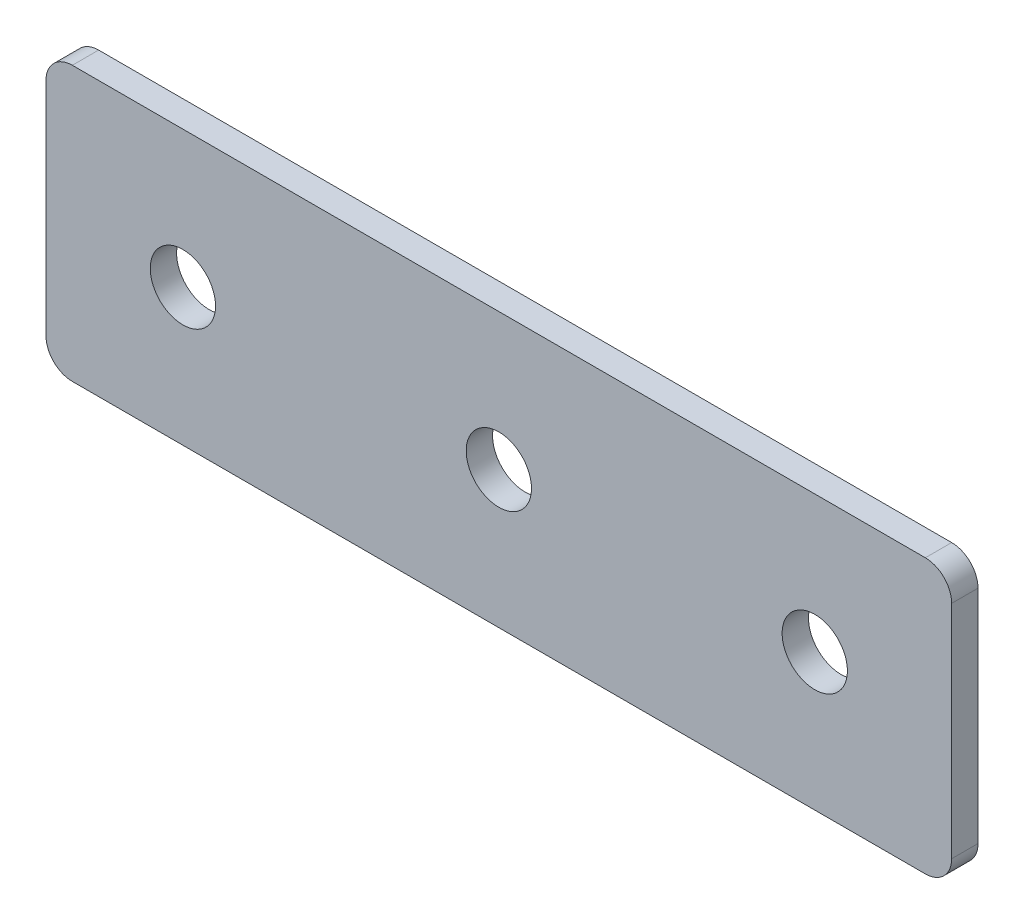
ISO-10303-21;
HEADER;
FILE_DESCRIPTION(('STEP AP214'),'2;1');
FILE_NAME('part.step','',(''),(''),'','','');
FILE_SCHEMA(('AUTOMOTIVE_DESIGN { 1 0 10303 214 1 1 1 1 }'));
ENDSEC;
DATA;
#1=APPLICATION_CONTEXT('core data for automotive mechanical design processes');
#2=APPLICATION_PROTOCOL_DEFINITION('international standard','automotive_design',2000,#1);
#3=PRODUCT_CONTEXT('',#1,'mechanical');
#4=PRODUCT('Part','Part','',(#3));
#5=PRODUCT_RELATED_PRODUCT_CATEGORY('part','',(#4));
#6=PRODUCT_DEFINITION_FORMATION('','',#4);
#7=PRODUCT_DEFINITION_CONTEXT('part definition',#1,'design');
#8=PRODUCT_DEFINITION('design','',#6,#7);
#9=PRODUCT_DEFINITION_SHAPE('','',#8);
#10=(LENGTH_UNIT() NAMED_UNIT(*) SI_UNIT(.MILLI.,.METRE.));
#11=(NAMED_UNIT(*) PLANE_ANGLE_UNIT() SI_UNIT($,.RADIAN.));
#12=(NAMED_UNIT(*) SI_UNIT($,.STERADIAN.) SOLID_ANGLE_UNIT());
#13=UNCERTAINTY_MEASURE_WITH_UNIT(LENGTH_MEASURE(1.E-05),#10,'distance_accuracy_value','');
#14=(GEOMETRIC_REPRESENTATION_CONTEXT(3) GLOBAL_UNCERTAINTY_ASSIGNED_CONTEXT((#13)) GLOBAL_UNIT_ASSIGNED_CONTEXT((#10,
#11,#12)) REPRESENTATION_CONTEXT('',''));
#15=CARTESIAN_POINT('',(0.,0.,0.));
#16=DIRECTION('',(0.,0.,1.));
#17=DIRECTION('',(1.,0.,0.));
#18=AXIS2_PLACEMENT_3D('',#15,#16,#17);
#19=CARTESIAN_POINT('',(0.,0.,2.5));
#20=DIRECTION('',(0.,0.,-1.));
#21=DIRECTION('',(-1.,0.,0.));
#22=AXIS2_PLACEMENT_3D('',#19,#20,#21);
#23=PLANE('',#22);
#24=CARTESIAN_POINT('',(60.,0.,2.5));
#25=DIRECTION('',(0.,0.,1.));
#26=DIRECTION('',(1.,0.,0.));
#27=AXIS2_PLACEMENT_3D('',#24,#25,#26);
#28=CIRCLE('',#27,3.1);
#29=CARTESIAN_POINT('',(63.1,0.,2.5));
#30=VERTEX_POINT('',#29);
#31=EDGE_CURVE('E154',#30,#30,#28,.T.);
#32=ORIENTED_EDGE('',*,*,#31,.F.);
#33=EDGE_LOOP('',(#32));
#34=FACE_BOUND('',#33,.T.);
#35=CARTESIAN_POINT('',(30.,0.,2.5));
#36=DIRECTION('',(0.,0.,1.));
#37=DIRECTION('',(1.,0.,0.));
#38=AXIS2_PLACEMENT_3D('',#35,#36,#37);
#39=CIRCLE('',#38,3.1);
#40=CARTESIAN_POINT('',(33.1,0.,2.5));
#41=VERTEX_POINT('',#40);
#42=EDGE_CURVE('E160',#41,#41,#39,.T.);
#43=ORIENTED_EDGE('',*,*,#42,.F.);
#44=EDGE_LOOP('',(#43));
#45=FACE_BOUND('',#44,.T.);
#46=CARTESIAN_POINT('',(0.,0.,2.5));
#47=DIRECTION('',(0.,0.,1.));
#48=DIRECTION('',(1.,0.,0.));
#49=AXIS2_PLACEMENT_3D('',#46,#47,#48);
#50=CIRCLE('',#49,3.1);
#51=CARTESIAN_POINT('',(3.1,0.,2.5));
#52=VERTEX_POINT('',#51);
#53=EDGE_CURVE('E107',#52,#52,#50,.T.);
#54=ORIENTED_EDGE('',*,*,#53,.F.);
#55=EDGE_LOOP('',(#54));
#56=FACE_BOUND('',#55,.T.);
#57=DIRECTION('',(1.,0.,0.));
#58=VECTOR('',#57,1.);
#59=CARTESIAN_POINT('',(-13.,-13.,2.5));
#60=LINE('',#59,#58);
#61=CARTESIAN_POINT('',(-10.5,-13.,2.5));
#62=VERTEX_POINT('',#61);
#63=CARTESIAN_POINT('',(70.5,-13.,2.5));
#64=VERTEX_POINT('',#63);
#65=EDGE_CURVE('E84',#62,#64,#60,.T.);
#66=ORIENTED_EDGE('',*,*,#65,.T.);
#67=CARTESIAN_POINT('',(70.5,-10.5,2.5));
#68=DIRECTION('',(0.,0.,-1.));
#69=DIRECTION('',(-1.,0.,0.));
#70=AXIS2_PLACEMENT_3D('',#67,#68,#69);
#71=CIRCLE('',#70,2.5);
#72=CARTESIAN_POINT('',(73.,-10.5,2.5));
#73=VERTEX_POINT('',#72);
#74=EDGE_CURVE('E91',#64,#73,#71,.F.);
#75=ORIENTED_EDGE('',*,*,#74,.T.);
#76=DIRECTION('',(0.,1.,0.));
#77=VECTOR('',#76,1.);
#78=CARTESIAN_POINT('',(73.,-13.,2.5));
#79=LINE('',#78,#77);
#80=CARTESIAN_POINT('',(73.,10.5,2.5));
#81=VERTEX_POINT('',#80);
#82=EDGE_CURVE('E102',#73,#81,#79,.T.);
#83=ORIENTED_EDGE('',*,*,#82,.T.);
#84=CARTESIAN_POINT('',(70.5,10.5,2.5));
#85=DIRECTION('',(0.,0.,-1.));
#86=DIRECTION('',(-1.,0.,0.));
#87=AXIS2_PLACEMENT_3D('',#84,#85,#86);
#88=CIRCLE('',#87,2.5);
#89=CARTESIAN_POINT('',(70.5,13.,2.5));
#90=VERTEX_POINT('',#89);
#91=EDGE_CURVE('E109',#81,#90,#88,.F.);
#92=ORIENTED_EDGE('',*,*,#91,.T.);
#93=DIRECTION('',(-1.,0.,0.));
#94=VECTOR('',#93,1.);
#95=CARTESIAN_POINT('',(73.,13.,2.5));
#96=LINE('',#95,#94);
#97=CARTESIAN_POINT('',(-10.5,13.,2.5));
#98=VERTEX_POINT('',#97);
#99=EDGE_CURVE('E139',#90,#98,#96,.T.);
#100=ORIENTED_EDGE('',*,*,#99,.T.);
#101=CARTESIAN_POINT('',(-10.5,10.5,2.5));
#102=DIRECTION('',(0.,0.,-1.));
#103=DIRECTION('',(-1.,0.,0.));
#104=AXIS2_PLACEMENT_3D('',#101,#102,#103);
#105=CIRCLE('',#104,2.5);
#106=CARTESIAN_POINT('',(-13.,10.5,2.5));
#107=VERTEX_POINT('',#106);
#108=EDGE_CURVE('E92',#98,#107,#105,.F.);
#109=ORIENTED_EDGE('',*,*,#108,.T.);
#110=DIRECTION('',(0.,-1.,0.));
#111=VECTOR('',#110,1.);
#112=CARTESIAN_POINT('',(-13.,13.,2.5));
#113=LINE('',#112,#111);
#114=CARTESIAN_POINT('',(-13.,-10.5,2.5));
#115=VERTEX_POINT('',#114);
#116=EDGE_CURVE('E86',#107,#115,#113,.T.);
#117=ORIENTED_EDGE('',*,*,#116,.T.);
#118=CARTESIAN_POINT('',(-10.5,-10.5,2.5));
#119=DIRECTION('',(0.,0.,-1.));
#120=DIRECTION('',(-1.,0.,0.));
#121=AXIS2_PLACEMENT_3D('',#118,#119,#120);
#122=CIRCLE('',#121,2.5);
#123=EDGE_CURVE('E82',#115,#62,#122,.F.);
#124=ORIENTED_EDGE('',*,*,#123,.T.);
#125=EDGE_LOOP('',(#66,#75,#83,#92,#100,#109,#117,#124));
#126=FACE_BOUND('',#125,.T.);
#127=ADVANCED_FACE('F16',(#34,#45,#56,#126),#23,.F.);
#128=CARTESIAN_POINT('',(0.,0.,0.));
#129=DIRECTION('',(0.,0.,-1.));
#130=DIRECTION('',(-1.,0.,0.));
#131=AXIS2_PLACEMENT_3D('',#128,#129,#130);
#132=PLANE('',#131);
#133=CARTESIAN_POINT('',(60.,0.,0.));
#134=DIRECTION('',(0.,0.,1.));
#135=DIRECTION('',(1.,0.,0.));
#136=AXIS2_PLACEMENT_3D('',#133,#134,#135);
#137=CIRCLE('',#136,3.1);
#138=CARTESIAN_POINT('',(63.1,0.,0.));
#139=VERTEX_POINT('',#138);
#140=EDGE_CURVE('E150',#139,#139,#137,.T.);
#141=ORIENTED_EDGE('',*,*,#140,.T.);
#142=EDGE_LOOP('',(#141));
#143=FACE_BOUND('',#142,.T.);
#144=CARTESIAN_POINT('',(30.,0.,0.));
#145=DIRECTION('',(0.,0.,1.));
#146=DIRECTION('',(1.,0.,0.));
#147=AXIS2_PLACEMENT_3D('',#144,#145,#146);
#148=CIRCLE('',#147,3.1);
#149=CARTESIAN_POINT('',(33.1,0.,0.));
#150=VERTEX_POINT('',#149);
#151=EDGE_CURVE('E157',#150,#150,#148,.T.);
#152=ORIENTED_EDGE('',*,*,#151,.T.);
#153=EDGE_LOOP('',(#152));
#154=FACE_BOUND('',#153,.T.);
#155=CARTESIAN_POINT('',(0.,0.,0.));
#156=DIRECTION('',(0.,0.,1.));
#157=DIRECTION('',(1.,0.,0.));
#158=AXIS2_PLACEMENT_3D('',#155,#156,#157);
#159=CIRCLE('',#158,3.1);
#160=CARTESIAN_POINT('',(3.1,0.,0.));
#161=VERTEX_POINT('',#160);
#162=EDGE_CURVE('E112',#161,#161,#159,.T.);
#163=ORIENTED_EDGE('',*,*,#162,.T.);
#164=EDGE_LOOP('',(#163));
#165=FACE_BOUND('',#164,.T.);
#166=DIRECTION('',(0.,1.,0.));
#167=VECTOR('',#166,1.);
#168=CARTESIAN_POINT('',(73.,-13.,0.));
#169=LINE('',#168,#167);
#170=CARTESIAN_POINT('',(73.,-10.5,0.));
#171=VERTEX_POINT('',#170);
#172=CARTESIAN_POINT('',(73.,10.5,0.));
#173=VERTEX_POINT('',#172);
#174=EDGE_CURVE('E141',#171,#173,#169,.T.);
#175=ORIENTED_EDGE('',*,*,#174,.F.);
#176=CARTESIAN_POINT('',(70.5,-10.5,0.));
#177=DIRECTION('',(0.,0.,-1.));
#178=DIRECTION('',(-1.,0.,0.));
#179=AXIS2_PLACEMENT_3D('',#176,#177,#178);
#180=CIRCLE('',#179,2.5);
#181=CARTESIAN_POINT('',(70.5,-13.,0.));
#182=VERTEX_POINT('',#181);
#183=EDGE_CURVE('E128',#171,#182,#180,.T.);
#184=ORIENTED_EDGE('',*,*,#183,.T.);
#185=DIRECTION('',(1.,0.,0.));
#186=VECTOR('',#185,1.);
#187=CARTESIAN_POINT('',(-13.,-13.,0.));
#188=LINE('',#187,#186);
#189=CARTESIAN_POINT('',(-10.5,-13.,0.));
#190=VERTEX_POINT('',#189);
#191=EDGE_CURVE('E138',#190,#182,#188,.T.);
#192=ORIENTED_EDGE('',*,*,#191,.F.);
#193=CARTESIAN_POINT('',(-10.5,-10.5,0.));
#194=DIRECTION('',(0.,0.,-1.));
#195=DIRECTION('',(-1.,0.,0.));
#196=AXIS2_PLACEMENT_3D('',#193,#194,#195);
#197=CIRCLE('',#196,2.5);
#198=CARTESIAN_POINT('',(-13.,-10.5,0.));
#199=VERTEX_POINT('',#198);
#200=EDGE_CURVE('E106',#190,#199,#197,.T.);
#201=ORIENTED_EDGE('',*,*,#200,.T.);
#202=DIRECTION('',(0.,-1.,0.));
#203=VECTOR('',#202,1.);
#204=CARTESIAN_POINT('',(-13.,13.,0.));
#205=LINE('',#204,#203);
#206=CARTESIAN_POINT('',(-13.,10.5,0.));
#207=VERTEX_POINT('',#206);
#208=EDGE_CURVE('E137',#207,#199,#205,.T.);
#209=ORIENTED_EDGE('',*,*,#208,.F.);
#210=CARTESIAN_POINT('',(-10.5,10.5,0.));
#211=DIRECTION('',(0.,0.,-1.));
#212=DIRECTION('',(-1.,0.,0.));
#213=AXIS2_PLACEMENT_3D('',#210,#211,#212);
#214=CIRCLE('',#213,2.5);
#215=CARTESIAN_POINT('',(-10.5,13.,0.));
#216=VERTEX_POINT('',#215);
#217=EDGE_CURVE('E31',#207,#216,#214,.T.);
#218=ORIENTED_EDGE('',*,*,#217,.T.);
#219=DIRECTION('',(-1.,0.,0.));
#220=VECTOR('',#219,1.);
#221=CARTESIAN_POINT('',(73.,13.,0.));
#222=LINE('',#221,#220);
#223=CARTESIAN_POINT('',(70.5,13.,0.));
#224=VERTEX_POINT('',#223);
#225=EDGE_CURVE('E148',#224,#216,#222,.T.);
#226=ORIENTED_EDGE('',*,*,#225,.F.);
#227=CARTESIAN_POINT('',(70.5,10.5,0.));
#228=DIRECTION('',(0.,0.,-1.));
#229=DIRECTION('',(-1.,0.,0.));
#230=AXIS2_PLACEMENT_3D('',#227,#228,#229);
#231=CIRCLE('',#230,2.5);
#232=EDGE_CURVE('E124',#224,#173,#231,.T.);
#233=ORIENTED_EDGE('',*,*,#232,.T.);
#234=EDGE_LOOP('',(#175,#184,#192,#201,#209,#218,#226,#233));
#235=FACE_BOUND('',#234,.T.);
#236=ADVANCED_FACE('F166',(#143,#154,#165,#235),#132,.T.);
#237=CARTESIAN_POINT('',(0.,0.,2.5));
#238=DIRECTION('',(0.,0.,-1.));
#239=DIRECTION('',(-1.,0.,0.));
#240=AXIS2_PLACEMENT_3D('',#237,#238,#239);
#241=CYLINDRICAL_SURFACE('',#240,3.1);
#242=ORIENTED_EDGE('',*,*,#53,.T.);
#243=EDGE_LOOP('',(#242));
#244=FACE_BOUND('',#243,.T.);
#245=ORIENTED_EDGE('',*,*,#162,.F.);
#246=EDGE_LOOP('',(#245));
#247=FACE_BOUND('',#246,.T.);
#248=ADVANCED_FACE('F172',(#244,#247),#241,.F.);
#249=CARTESIAN_POINT('',(30.,0.,2.5));
#250=DIRECTION('',(0.,0.,-1.));
#251=DIRECTION('',(-1.,0.,0.));
#252=AXIS2_PLACEMENT_3D('',#249,#250,#251);
#253=CYLINDRICAL_SURFACE('',#252,3.1);
#254=ORIENTED_EDGE('',*,*,#42,.T.);
#255=EDGE_LOOP('',(#254));
#256=FACE_BOUND('',#255,.T.);
#257=ORIENTED_EDGE('',*,*,#151,.F.);
#258=EDGE_LOOP('',(#257));
#259=FACE_BOUND('',#258,.T.);
#260=ADVANCED_FACE('F169',(#256,#259),#253,.F.);
#261=CARTESIAN_POINT('',(60.,0.,2.5));
#262=DIRECTION('',(0.,0.,-1.));
#263=DIRECTION('',(-1.,0.,0.));
#264=AXIS2_PLACEMENT_3D('',#261,#262,#263);
#265=CYLINDRICAL_SURFACE('',#264,3.1);
#266=ORIENTED_EDGE('',*,*,#31,.T.);
#267=EDGE_LOOP('',(#266));
#268=FACE_BOUND('',#267,.T.);
#269=ORIENTED_EDGE('',*,*,#140,.F.);
#270=EDGE_LOOP('',(#269));
#271=FACE_BOUND('',#270,.T.);
#272=ADVANCED_FACE('F171',(#268,#271),#265,.F.);
#273=CARTESIAN_POINT('',(-13.,13.,0.));
#274=DIRECTION('',(-1.,0.,0.));
#275=DIRECTION('',(0.,0.,1.));
#276=AXIS2_PLACEMENT_3D('',#273,#274,#275);
#277=PLANE('',#276);
#278=ORIENTED_EDGE('',*,*,#208,.T.);
#279=DIRECTION('',(0.,0.,1.));
#280=VECTOR('',#279,1.);
#281=CARTESIAN_POINT('',(-13.,-10.5,0.));
#282=LINE('',#281,#280);
#283=EDGE_CURVE('E132',#199,#115,#282,.T.);
#284=ORIENTED_EDGE('',*,*,#283,.T.);
#285=ORIENTED_EDGE('',*,*,#116,.F.);
#286=DIRECTION('',(0.,0.,1.));
#287=VECTOR('',#286,1.);
#288=CARTESIAN_POINT('',(-13.,10.5,0.));
#289=LINE('',#288,#287);
#290=EDGE_CURVE('E130',#107,#207,#289,.F.);
#291=ORIENTED_EDGE('',*,*,#290,.T.);
#292=EDGE_LOOP('',(#278,#284,#285,#291));
#293=FACE_BOUND('',#292,.T.);
#294=ADVANCED_FACE('F135',(#293),#277,.T.);
#295=CARTESIAN_POINT('',(73.,13.,0.));
#296=DIRECTION('',(0.,1.,0.));
#297=DIRECTION('',(0.,0.,1.));
#298=AXIS2_PLACEMENT_3D('',#295,#296,#297);
#299=PLANE('',#298);
#300=ORIENTED_EDGE('',*,*,#225,.T.);
#301=DIRECTION('',(0.,0.,1.));
#302=VECTOR('',#301,1.);
#303=CARTESIAN_POINT('',(-10.5,13.,0.));
#304=LINE('',#303,#302);
#305=EDGE_CURVE('E10',#216,#98,#304,.T.);
#306=ORIENTED_EDGE('',*,*,#305,.T.);
#307=ORIENTED_EDGE('',*,*,#99,.F.);
#308=DIRECTION('',(0.,0.,1.));
#309=VECTOR('',#308,1.);
#310=CARTESIAN_POINT('',(70.5,13.,0.));
#311=LINE('',#310,#309);
#312=EDGE_CURVE('E24',#90,#224,#311,.F.);
#313=ORIENTED_EDGE('',*,*,#312,.T.);
#314=EDGE_LOOP('',(#300,#306,#307,#313));
#315=FACE_BOUND('',#314,.T.);
#316=ADVANCED_FACE('F208',(#315),#299,.T.);
#317=CARTESIAN_POINT('',(73.,-13.,0.));
#318=DIRECTION('',(1.,0.,0.));
#319=DIRECTION('',(0.,0.,-1.));
#320=AXIS2_PLACEMENT_3D('',#317,#318,#319);
#321=PLANE('',#320);
#322=ORIENTED_EDGE('',*,*,#82,.F.);
#323=DIRECTION('',(0.,0.,1.));
#324=VECTOR('',#323,1.);
#325=CARTESIAN_POINT('',(73.,-10.5,0.));
#326=LINE('',#325,#324);
#327=EDGE_CURVE('E122',#73,#171,#326,.F.);
#328=ORIENTED_EDGE('',*,*,#327,.T.);
#329=ORIENTED_EDGE('',*,*,#174,.T.);
#330=DIRECTION('',(0.,0.,1.));
#331=VECTOR('',#330,1.);
#332=CARTESIAN_POINT('',(73.,10.5,0.));
#333=LINE('',#332,#331);
#334=EDGE_CURVE('E119',#173,#81,#333,.T.);
#335=ORIENTED_EDGE('',*,*,#334,.T.);
#336=EDGE_LOOP('',(#322,#328,#329,#335));
#337=FACE_BOUND('',#336,.T.);
#338=ADVANCED_FACE('F213',(#337),#321,.T.);
#339=CARTESIAN_POINT('',(-13.,-13.,0.));
#340=DIRECTION('',(0.,-1.,0.));
#341=DIRECTION('',(0.,0.,-1.));
#342=AXIS2_PLACEMENT_3D('',#339,#340,#341);
#343=PLANE('',#342);
#344=ORIENTED_EDGE('',*,*,#191,.T.);
#345=DIRECTION('',(0.,0.,1.));
#346=VECTOR('',#345,1.);
#347=CARTESIAN_POINT('',(70.5,-13.,0.));
#348=LINE('',#347,#346);
#349=EDGE_CURVE('E101',#182,#64,#348,.T.);
#350=ORIENTED_EDGE('',*,*,#349,.T.);
#351=ORIENTED_EDGE('',*,*,#65,.F.);
#352=DIRECTION('',(0.,0.,1.));
#353=VECTOR('',#352,1.);
#354=CARTESIAN_POINT('',(-10.5,-13.,0.));
#355=LINE('',#354,#353);
#356=EDGE_CURVE('E98',#62,#190,#355,.F.);
#357=ORIENTED_EDGE('',*,*,#356,.T.);
#358=EDGE_LOOP('',(#344,#350,#351,#357));
#359=FACE_BOUND('',#358,.T.);
#360=ADVANCED_FACE('F97',(#359),#343,.T.);
#361=CARTESIAN_POINT('',(70.5,-10.5,0.));
#362=DIRECTION('',(0.,0.,1.));
#363=DIRECTION('',(1.,0.,0.));
#364=AXIS2_PLACEMENT_3D('',#361,#362,#363);
#365=CYLINDRICAL_SURFACE('',#364,2.5);
#366=ORIENTED_EDGE('',*,*,#183,.F.);
#367=ORIENTED_EDGE('',*,*,#327,.F.);
#368=ORIENTED_EDGE('',*,*,#74,.F.);
#369=ORIENTED_EDGE('',*,*,#349,.F.);
#370=EDGE_LOOP('',(#366,#367,#368,#369));
#371=FACE_BOUND('',#370,.T.);
#372=ADVANCED_FACE('F195',(#371),#365,.T.);
#373=CARTESIAN_POINT('',(-10.5,-10.5,0.));
#374=DIRECTION('',(0.,0.,1.));
#375=DIRECTION('',(1.,0.,0.));
#376=AXIS2_PLACEMENT_3D('',#373,#374,#375);
#377=CYLINDRICAL_SURFACE('',#376,2.5);
#378=ORIENTED_EDGE('',*,*,#200,.F.);
#379=ORIENTED_EDGE('',*,*,#356,.F.);
#380=ORIENTED_EDGE('',*,*,#123,.F.);
#381=ORIENTED_EDGE('',*,*,#283,.F.);
#382=EDGE_LOOP('',(#378,#379,#380,#381));
#383=FACE_BOUND('',#382,.T.);
#384=ADVANCED_FACE('F105',(#383),#377,.T.);
#385=CARTESIAN_POINT('',(-10.5,10.5,0.));
#386=DIRECTION('',(0.,0.,1.));
#387=DIRECTION('',(1.,0.,0.));
#388=AXIS2_PLACEMENT_3D('',#385,#386,#387);
#389=CYLINDRICAL_SURFACE('',#388,2.5);
#390=ORIENTED_EDGE('',*,*,#217,.F.);
#391=ORIENTED_EDGE('',*,*,#290,.F.);
#392=ORIENTED_EDGE('',*,*,#108,.F.);
#393=ORIENTED_EDGE('',*,*,#305,.F.);
#394=EDGE_LOOP('',(#390,#391,#392,#393));
#395=FACE_BOUND('',#394,.T.);
#396=ADVANCED_FACE('F200',(#395),#389,.T.);
#397=CARTESIAN_POINT('',(70.5,10.5,0.));
#398=DIRECTION('',(0.,0.,1.));
#399=DIRECTION('',(1.,0.,0.));
#400=AXIS2_PLACEMENT_3D('',#397,#398,#399);
#401=CYLINDRICAL_SURFACE('',#400,2.5);
#402=ORIENTED_EDGE('',*,*,#232,.F.);
#403=ORIENTED_EDGE('',*,*,#312,.F.);
#404=ORIENTED_EDGE('',*,*,#91,.F.);
#405=ORIENTED_EDGE('',*,*,#334,.F.);
#406=EDGE_LOOP('',(#402,#403,#404,#405));
#407=FACE_BOUND('',#406,.T.);
#408=ADVANCED_FACE('F18',(#407),#401,.T.);
#409=CLOSED_SHELL('',(#127,#236,#248,#260,#272,#294,#316,#338,#360,#372,#384,#396,#408));
#410=MANIFOLD_SOLID_BREP('B1',#409);
#411=ADVANCED_BREP_SHAPE_REPRESENTATION('',(#18,#410),#14);
#412=SHAPE_DEFINITION_REPRESENTATION(#9,#411);
ENDSEC;
END-ISO-10303-21;
